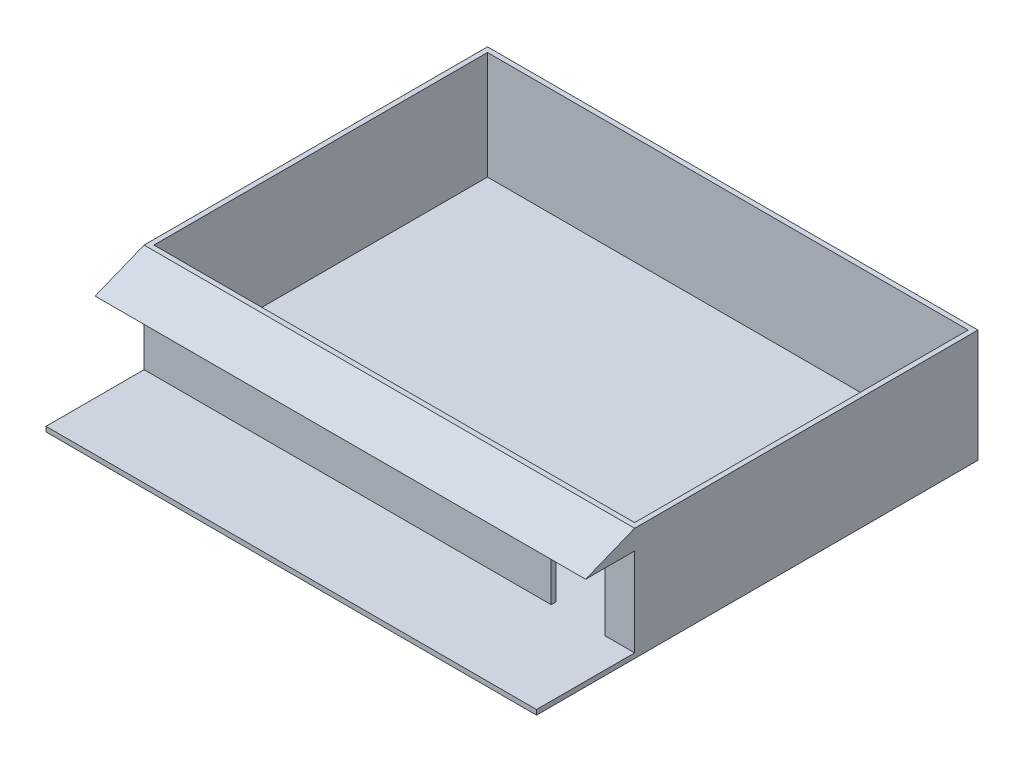
ISO-10303-21;
HEADER;
FILE_DESCRIPTION(('STEP AP214'),'2;1');
FILE_NAME('part.step','',(''),(''),'','','');
FILE_SCHEMA(('AUTOMOTIVE_DESIGN { 1 0 10303 214 1 1 1 1 }'));
ENDSEC;
DATA;
#1=APPLICATION_CONTEXT('core data for automotive mechanical design processes');
#2=APPLICATION_PROTOCOL_DEFINITION('international standard','automotive_design',2000,#1);
#3=PRODUCT_CONTEXT('',#1,'mechanical');
#4=PRODUCT('Part','Part','',(#3));
#5=PRODUCT_RELATED_PRODUCT_CATEGORY('part','',(#4));
#6=PRODUCT_DEFINITION_FORMATION('','',#4);
#7=PRODUCT_DEFINITION_CONTEXT('part definition',#1,'design');
#8=PRODUCT_DEFINITION('design','',#6,#7);
#9=PRODUCT_DEFINITION_SHAPE('','',#8);
#10=(LENGTH_UNIT() NAMED_UNIT(*) SI_UNIT(.MILLI.,.METRE.));
#11=(NAMED_UNIT(*) PLANE_ANGLE_UNIT() SI_UNIT($,.RADIAN.));
#12=(NAMED_UNIT(*) SI_UNIT($,.STERADIAN.) SOLID_ANGLE_UNIT());
#13=UNCERTAINTY_MEASURE_WITH_UNIT(LENGTH_MEASURE(1.E-05),#10,'distance_accuracy_value','');
#14=(GEOMETRIC_REPRESENTATION_CONTEXT(3) GLOBAL_UNCERTAINTY_ASSIGNED_CONTEXT((#13)) GLOBAL_UNIT_ASSIGNED_CONTEXT((#10,
#11,#12)) REPRESENTATION_CONTEXT('',''));
#15=CARTESIAN_POINT('',(0.,0.,0.));
#16=DIRECTION('',(0.,0.,1.));
#17=DIRECTION('',(1.,0.,0.));
#18=AXIS2_PLACEMENT_3D('',#15,#16,#17);
#19=CARTESIAN_POINT('',(-500.,230.,250.));
#20=DIRECTION('',(0.,0.,-1.));
#21=DIRECTION('',(-1.,0.,0.));
#22=AXIS2_PLACEMENT_3D('',#19,#20,#21);
#23=PLANE('',#22);
#24=DIRECTION('',(0.,-1.,0.));
#25=VECTOR('',#24,1.);
#26=CARTESIAN_POINT('',(500.,230.,250.));
#27=LINE('',#26,#25);
#28=CARTESIAN_POINT('',(500.,190.,250.));
#29=VERTEX_POINT('',#28);
#30=CARTESIAN_POINT('',(500.,10.,250.));
#31=VERTEX_POINT('',#30);
#32=EDGE_CURVE('E164',#29,#31,#27,.T.);
#33=ORIENTED_EDGE('',*,*,#32,.F.);
#34=DIRECTION('',(-1.,0.,0.));
#35=VECTOR('',#34,1.);
#36=CARTESIAN_POINT('',(607.70329614269,190.,250.));
#37=LINE('',#36,#35);
#38=CARTESIAN_POINT('',(-500.,190.,250.));
#39=VERTEX_POINT('',#38);
#40=EDGE_CURVE('E149',#29,#39,#37,.T.);
#41=ORIENTED_EDGE('',*,*,#40,.T.);
#42=DIRECTION('',(0.,-1.,0.));
#43=VECTOR('',#42,1.);
#44=CARTESIAN_POINT('',(-500.,230.,250.));
#45=LINE('',#44,#43);
#46=CARTESIAN_POINT('',(-500.,10.,250.));
#47=VERTEX_POINT('',#46);
#48=EDGE_CURVE('E161',#39,#47,#45,.T.);
#49=ORIENTED_EDGE('',*,*,#48,.T.);
#50=DIRECTION('',(1.,0.,0.));
#51=VECTOR('',#50,1.);
#52=CARTESIAN_POINT('',(-500.,10.,250.));
#53=LINE('',#52,#51);
#54=CARTESIAN_POINT('',(330.,10.,250.));
#55=VERTEX_POINT('',#54);
#56=EDGE_CURVE('E222',#47,#55,#53,.T.);
#57=ORIENTED_EDGE('',*,*,#56,.T.);
#58=DIRECTION('',(0.,1.,0.));
#59=VECTOR('',#58,1.);
#60=CARTESIAN_POINT('',(330.,230.,250.));
#61=LINE('',#60,#59);
#62=CARTESIAN_POINT('',(330.,180.,250.));
#63=VERTEX_POINT('',#62);
#64=EDGE_CURVE('E276',#55,#63,#61,.T.);
#65=ORIENTED_EDGE('',*,*,#64,.T.);
#66=DIRECTION('',(1.,0.,0.));
#67=VECTOR('',#66,1.);
#68=CARTESIAN_POINT('',(-500.,180.,250.));
#69=LINE('',#68,#67);
#70=CARTESIAN_POINT('',(440.,180.,250.));
#71=VERTEX_POINT('',#70);
#72=EDGE_CURVE('E261',#63,#71,#69,.T.);
#73=ORIENTED_EDGE('',*,*,#72,.T.);
#74=DIRECTION('',(0.,1.,0.));
#75=VECTOR('',#74,1.);
#76=CARTESIAN_POINT('',(440.,230.,250.));
#77=LINE('',#76,#75);
#78=CARTESIAN_POINT('',(440.,10.,250.));
#79=VERTEX_POINT('',#78);
#80=EDGE_CURVE('E271',#79,#71,#77,.T.);
#81=ORIENTED_EDGE('',*,*,#80,.F.);
#82=EDGE_CURVE('E227',#79,#31,#53,.T.);
#83=ORIENTED_EDGE('',*,*,#82,.T.);
#84=EDGE_LOOP('',(#33,#41,#49,#57,#65,#73,#81,#83));
#85=FACE_BOUND('',#84,.T.);
#86=ADVANCED_FACE('F34',(#85),#23,.F.);
#87=CARTESIAN_POINT('',(-490.,230.,240.));
#88=DIRECTION('',(0.,0.,-1.));
#89=DIRECTION('',(-1.,0.,0.));
#90=AXIS2_PLACEMENT_3D('',#87,#88,#89);
#91=PLANE('',#90);
#92=DIRECTION('',(1.,0.,0.));
#93=VECTOR('',#92,1.);
#94=CARTESIAN_POINT('',(-490.,10.,240.));
#95=LINE('',#94,#93);
#96=CARTESIAN_POINT('',(440.,10.,240.));
#97=VERTEX_POINT('',#96);
#98=CARTESIAN_POINT('',(490.,10.,240.));
#99=VERTEX_POINT('',#98);
#100=EDGE_CURVE('E251',#97,#99,#95,.T.);
#101=ORIENTED_EDGE('',*,*,#100,.F.);
#102=DIRECTION('',(0.,1.,0.));
#103=VECTOR('',#102,1.);
#104=CARTESIAN_POINT('',(440.,230.,240.));
#105=LINE('',#104,#103);
#106=CARTESIAN_POINT('',(440.,180.,240.));
#107=VERTEX_POINT('',#106);
#108=EDGE_CURVE('E273',#97,#107,#105,.T.);
#109=ORIENTED_EDGE('',*,*,#108,.T.);
#110=DIRECTION('',(1.,0.,0.));
#111=VECTOR('',#110,1.);
#112=CARTESIAN_POINT('',(-490.,180.,240.));
#113=LINE('',#112,#111);
#114=CARTESIAN_POINT('',(330.,180.,240.));
#115=VERTEX_POINT('',#114);
#116=EDGE_CURVE('E11',#115,#107,#113,.T.);
#117=ORIENTED_EDGE('',*,*,#116,.F.);
#118=DIRECTION('',(0.,1.,0.));
#119=VECTOR('',#118,1.);
#120=CARTESIAN_POINT('',(330.,230.,240.));
#121=LINE('',#120,#119);
#122=CARTESIAN_POINT('',(330.,10.,240.));
#123=VERTEX_POINT('',#122);
#124=EDGE_CURVE('E278',#123,#115,#121,.T.);
#125=ORIENTED_EDGE('',*,*,#124,.F.);
#126=CARTESIAN_POINT('',(-490.,10.,240.));
#127=VERTEX_POINT('',#126);
#128=EDGE_CURVE('E248',#127,#123,#95,.T.);
#129=ORIENTED_EDGE('',*,*,#128,.F.);
#130=DIRECTION('',(0.,-1.,0.));
#131=VECTOR('',#130,1.);
#132=CARTESIAN_POINT('',(-490.,230.,240.));
#133=LINE('',#132,#131);
#134=CARTESIAN_POINT('',(-490.,230.,240.));
#135=VERTEX_POINT('',#134);
#136=EDGE_CURVE('E241',#135,#127,#133,.T.);
#137=ORIENTED_EDGE('',*,*,#136,.F.);
#138=DIRECTION('',(1.,0.,0.));
#139=VECTOR('',#138,1.);
#140=CARTESIAN_POINT('',(-490.,230.,240.));
#141=LINE('',#140,#139);
#142=CARTESIAN_POINT('',(490.,230.,240.));
#143=VERTEX_POINT('',#142);
#144=EDGE_CURVE('E247',#135,#143,#141,.T.);
#145=ORIENTED_EDGE('',*,*,#144,.T.);
#146=DIRECTION('',(0.,-1.,0.));
#147=VECTOR('',#146,1.);
#148=CARTESIAN_POINT('',(490.,230.,240.));
#149=LINE('',#148,#147);
#150=EDGE_CURVE('E244',#143,#99,#149,.T.);
#151=ORIENTED_EDGE('',*,*,#150,.T.);
#152=EDGE_LOOP('',(#101,#109,#117,#125,#129,#137,#145,#151));
#153=FACE_BOUND('',#152,.T.);
#154=ADVANCED_FACE('F313',(#153),#91,.T.);
#155=CARTESIAN_POINT('',(500.,10.,-450.));
#156=DIRECTION('',(-1.,0.,0.));
#157=DIRECTION('',(0.,0.,1.));
#158=AXIS2_PLACEMENT_3D('',#155,#156,#157);
#159=PLANE('',#158);
#160=DIRECTION('',(0.,0.,-1.));
#161=VECTOR('',#160,1.);
#162=CARTESIAN_POINT('',(500.,0.,-450.));
#163=LINE('',#162,#161);
#164=CARTESIAN_POINT('',(500.,0.,450.));
#165=VERTEX_POINT('',#164);
#166=CARTESIAN_POINT('',(500.,0.,-450.));
#167=VERTEX_POINT('',#166);
#168=EDGE_CURVE('E170',#165,#167,#163,.T.);
#169=ORIENTED_EDGE('',*,*,#168,.T.);
#170=DIRECTION('',(0.,-1.,0.));
#171=VECTOR('',#170,1.);
#172=CARTESIAN_POINT('',(500.,10.,-450.));
#173=LINE('',#172,#171);
#174=CARTESIAN_POINT('',(500.,230.,-450.));
#175=VERTEX_POINT('',#174);
#176=EDGE_CURVE('E42',#175,#167,#173,.T.);
#177=ORIENTED_EDGE('',*,*,#176,.F.);
#178=DIRECTION('',(0.,0.,-1.));
#179=VECTOR('',#178,1.);
#180=CARTESIAN_POINT('',(500.,230.,250.));
#181=LINE('',#180,#179);
#182=CARTESIAN_POINT('',(500.,230.,250.));
#183=VERTEX_POINT('',#182);
#184=EDGE_CURVE('E226',#183,#175,#181,.T.);
#185=ORIENTED_EDGE('',*,*,#184,.F.);
#186=DIRECTION('',(0.,-0.371390676354103,0.928476690885259));
#187=VECTOR('',#186,1.);
#188=CARTESIAN_POINT('',(500.,230.,250.));
#189=LINE('',#188,#187);
#190=CARTESIAN_POINT('',(500.,190.,350.));
#191=VERTEX_POINT('',#190);
#192=EDGE_CURVE('E286',#183,#191,#189,.T.);
#193=ORIENTED_EDGE('',*,*,#192,.T.);
#194=DIRECTION('',(0.,0.,-1.));
#195=VECTOR('',#194,1.);
#196=CARTESIAN_POINT('',(500.,190.,350.));
#197=LINE('',#196,#195);
#198=EDGE_CURVE('E285',#191,#29,#197,.T.);
#199=ORIENTED_EDGE('',*,*,#198,.T.);
#200=ORIENTED_EDGE('',*,*,#32,.T.);
#201=DIRECTION('',(0.,0.,-1.));
#202=VECTOR('',#201,1.);
#203=CARTESIAN_POINT('',(500.,10.,-450.));
#204=LINE('',#203,#202);
#205=CARTESIAN_POINT('',(500.,10.,450.));
#206=VERTEX_POINT('',#205);
#207=EDGE_CURVE('E179',#206,#31,#204,.T.);
#208=ORIENTED_EDGE('',*,*,#207,.F.);
#209=DIRECTION('',(0.,-1.,0.));
#210=VECTOR('',#209,1.);
#211=CARTESIAN_POINT('',(500.,10.,450.));
#212=LINE('',#211,#210);
#213=EDGE_CURVE('E185',#206,#165,#212,.T.);
#214=ORIENTED_EDGE('',*,*,#213,.T.);
#215=EDGE_LOOP('',(#169,#177,#185,#193,#199,#200,#208,#214));
#216=FACE_BOUND('',#215,.T.);
#217=ADVANCED_FACE('F36',(#216),#159,.F.);
#218=CARTESIAN_POINT('',(-500.,10.,-450.));
#219=DIRECTION('',(0.,0.,1.));
#220=DIRECTION('',(1.,0.,0.));
#221=AXIS2_PLACEMENT_3D('',#218,#219,#220);
#222=PLANE('',#221);
#223=DIRECTION('',(-1.,0.,0.));
#224=VECTOR('',#223,1.);
#225=CARTESIAN_POINT('',(-500.,0.,-450.));
#226=LINE('',#225,#224);
#227=CARTESIAN_POINT('',(-500.,0.,-450.));
#228=VERTEX_POINT('',#227);
#229=EDGE_CURVE('E173',#167,#228,#226,.T.);
#230=ORIENTED_EDGE('',*,*,#229,.T.);
#231=DIRECTION('',(0.,-1.,0.));
#232=VECTOR('',#231,1.);
#233=CARTESIAN_POINT('',(-500.,10.,-450.));
#234=LINE('',#233,#232);
#235=CARTESIAN_POINT('',(-500.,230.,-450.));
#236=VERTEX_POINT('',#235);
#237=EDGE_CURVE('E196',#236,#228,#234,.T.);
#238=ORIENTED_EDGE('',*,*,#237,.F.);
#239=DIRECTION('',(-1.,0.,0.));
#240=VECTOR('',#239,1.);
#241=CARTESIAN_POINT('',(-500.,230.,-450.));
#242=LINE('',#241,#240);
#243=EDGE_CURVE('E203',#175,#236,#242,.T.);
#244=ORIENTED_EDGE('',*,*,#243,.F.);
#245=ORIENTED_EDGE('',*,*,#176,.T.);
#246=EDGE_LOOP('',(#230,#238,#244,#245));
#247=FACE_BOUND('',#246,.T.);
#248=ADVANCED_FACE('F201',(#247),#222,.F.);
#249=CARTESIAN_POINT('',(-500.,10.,-450.));
#250=DIRECTION('',(1.,0.,0.));
#251=DIRECTION('',(0.,0.,-1.));
#252=AXIS2_PLACEMENT_3D('',#249,#250,#251);
#253=PLANE('',#252);
#254=DIRECTION('',(0.,0.,1.));
#255=VECTOR('',#254,1.);
#256=CARTESIAN_POINT('',(-500.,0.,-450.));
#257=LINE('',#256,#255);
#258=CARTESIAN_POINT('',(-500.,0.,450.));
#259=VERTEX_POINT('',#258);
#260=EDGE_CURVE('E188',#228,#259,#257,.T.);
#261=ORIENTED_EDGE('',*,*,#260,.T.);
#262=DIRECTION('',(0.,-1.,0.));
#263=VECTOR('',#262,1.);
#264=CARTESIAN_POINT('',(-500.,10.,450.));
#265=LINE('',#264,#263);
#266=CARTESIAN_POINT('',(-500.,10.,450.));
#267=VERTEX_POINT('',#266);
#268=EDGE_CURVE('E193',#267,#259,#265,.T.);
#269=ORIENTED_EDGE('',*,*,#268,.F.);
#270=DIRECTION('',(0.,0.,1.));
#271=VECTOR('',#270,1.);
#272=CARTESIAN_POINT('',(-500.,10.,-450.));
#273=LINE('',#272,#271);
#274=EDGE_CURVE('E169',#47,#267,#273,.T.);
#275=ORIENTED_EDGE('',*,*,#274,.F.);
#276=ORIENTED_EDGE('',*,*,#48,.F.);
#277=DIRECTION('',(0.,0.,1.));
#278=VECTOR('',#277,1.);
#279=CARTESIAN_POINT('',(-500.,190.,350.));
#280=LINE('',#279,#278);
#281=CARTESIAN_POINT('',(-500.,190.,350.));
#282=VERTEX_POINT('',#281);
#283=EDGE_CURVE('E145',#39,#282,#280,.T.);
#284=ORIENTED_EDGE('',*,*,#283,.T.);
#285=DIRECTION('',(0.,0.371390676354103,-0.928476690885259));
#286=VECTOR('',#285,1.);
#287=CARTESIAN_POINT('',(-500.,230.,250.));
#288=LINE('',#287,#286);
#289=CARTESIAN_POINT('',(-500.,230.,250.));
#290=VERTEX_POINT('',#289);
#291=EDGE_CURVE('E157',#282,#290,#288,.T.);
#292=ORIENTED_EDGE('',*,*,#291,.T.);
#293=DIRECTION('',(0.,0.,1.));
#294=VECTOR('',#293,1.);
#295=CARTESIAN_POINT('',(-500.,230.,250.));
#296=LINE('',#295,#294);
#297=EDGE_CURVE('E233',#236,#290,#296,.T.);
#298=ORIENTED_EDGE('',*,*,#297,.F.);
#299=ORIENTED_EDGE('',*,*,#237,.T.);
#300=EDGE_LOOP('',(#261,#269,#275,#276,#284,#292,#298,#299));
#301=FACE_BOUND('',#300,.T.);
#302=ADVANCED_FACE('F167',(#301),#253,.F.);
#303=CARTESIAN_POINT('',(-500.,10.,450.));
#304=DIRECTION('',(0.,0.,-1.));
#305=DIRECTION('',(-1.,0.,0.));
#306=AXIS2_PLACEMENT_3D('',#303,#304,#305);
#307=PLANE('',#306);
#308=DIRECTION('',(1.,0.,0.));
#309=VECTOR('',#308,1.);
#310=CARTESIAN_POINT('',(-500.,0.,450.));
#311=LINE('',#310,#309);
#312=EDGE_CURVE('E182',#259,#165,#311,.T.);
#313=ORIENTED_EDGE('',*,*,#312,.T.);
#314=ORIENTED_EDGE('',*,*,#213,.F.);
#315=DIRECTION('',(1.,0.,0.));
#316=VECTOR('',#315,1.);
#317=CARTESIAN_POINT('',(-500.,10.,450.));
#318=LINE('',#317,#316);
#319=EDGE_CURVE('E184',#267,#206,#318,.T.);
#320=ORIENTED_EDGE('',*,*,#319,.F.);
#321=ORIENTED_EDGE('',*,*,#268,.T.);
#322=EDGE_LOOP('',(#313,#314,#320,#321));
#323=FACE_BOUND('',#322,.T.);
#324=ADVANCED_FACE('F217',(#323),#307,.F.);
#325=CARTESIAN_POINT('',(0.,10.,0.));
#326=DIRECTION('',(0.,1.,0.));
#327=DIRECTION('',(0.,0.,1.));
#328=AXIS2_PLACEMENT_3D('',#325,#326,#327);
#329=PLANE('',#328);
#330=ORIENTED_EDGE('',*,*,#319,.T.);
#331=ORIENTED_EDGE('',*,*,#207,.T.);
#332=ORIENTED_EDGE('',*,*,#82,.F.);
#333=DIRECTION('',(0.,0.,1.));
#334=VECTOR('',#333,1.);
#335=CARTESIAN_POINT('',(440.,10.,170.));
#336=LINE('',#335,#334);
#337=EDGE_CURVE('E280',#97,#79,#336,.T.);
#338=ORIENTED_EDGE('',*,*,#337,.F.);
#339=ORIENTED_EDGE('',*,*,#100,.T.);
#340=DIRECTION('',(0.,0.,-1.));
#341=VECTOR('',#340,1.);
#342=CARTESIAN_POINT('',(490.,10.,240.));
#343=LINE('',#342,#341);
#344=CARTESIAN_POINT('',(490.,10.,-440.));
#345=VERTEX_POINT('',#344);
#346=EDGE_CURVE('E258',#99,#345,#343,.T.);
#347=ORIENTED_EDGE('',*,*,#346,.T.);
#348=DIRECTION('',(-1.,0.,0.));
#349=VECTOR('',#348,1.);
#350=CARTESIAN_POINT('',(-490.,10.,-440.));
#351=LINE('',#350,#349);
#352=CARTESIAN_POINT('',(-490.,10.,-440.));
#353=VERTEX_POINT('',#352);
#354=EDGE_CURVE('E255',#345,#353,#351,.T.);
#355=ORIENTED_EDGE('',*,*,#354,.T.);
#356=DIRECTION('',(0.,0.,1.));
#357=VECTOR('',#356,1.);
#358=CARTESIAN_POINT('',(-490.,10.,240.));
#359=LINE('',#358,#357);
#360=EDGE_CURVE('E252',#353,#127,#359,.T.);
#361=ORIENTED_EDGE('',*,*,#360,.T.);
#362=ORIENTED_EDGE('',*,*,#128,.T.);
#363=DIRECTION('',(0.,0.,1.));
#364=VECTOR('',#363,1.);
#365=CARTESIAN_POINT('',(330.,10.,170.));
#366=LINE('',#365,#364);
#367=EDGE_CURVE('E224',#123,#55,#366,.T.);
#368=ORIENTED_EDGE('',*,*,#367,.T.);
#369=ORIENTED_EDGE('',*,*,#56,.F.);
#370=ORIENTED_EDGE('',*,*,#274,.T.);
#371=EDGE_LOOP('',(#330,#331,#332,#338,#339,#347,#355,#361,#362,#368,#369,#370));
#372=FACE_BOUND('',#371,.T.);
#373=ADVANCED_FACE('F219',(#372),#329,.T.);
#374=CARTESIAN_POINT('',(0.,0.,0.));
#375=DIRECTION('',(0.,1.,0.));
#376=DIRECTION('',(0.,0.,1.));
#377=AXIS2_PLACEMENT_3D('',#374,#375,#376);
#378=PLANE('',#377);
#379=ORIENTED_EDGE('',*,*,#168,.F.);
#380=ORIENTED_EDGE('',*,*,#312,.F.);
#381=ORIENTED_EDGE('',*,*,#260,.F.);
#382=ORIENTED_EDGE('',*,*,#229,.F.);
#383=EDGE_LOOP('',(#379,#380,#381,#382));
#384=FACE_BOUND('',#383,.T.);
#385=ADVANCED_FACE('F212',(#384),#378,.F.);
#386=CARTESIAN_POINT('',(0.,230.,0.));
#387=DIRECTION('',(0.,-1.,0.));
#388=DIRECTION('',(0.,0.,-1.));
#389=AXIS2_PLACEMENT_3D('',#386,#387,#388);
#390=PLANE('',#389);
#391=ORIENTED_EDGE('',*,*,#184,.T.);
#392=ORIENTED_EDGE('',*,*,#243,.T.);
#393=ORIENTED_EDGE('',*,*,#297,.T.);
#394=DIRECTION('',(1.,0.,0.));
#395=VECTOR('',#394,1.);
#396=CARTESIAN_POINT('',(-500.,230.,250.));
#397=LINE('',#396,#395);
#398=EDGE_CURVE('E175',#290,#183,#397,.T.);
#399=ORIENTED_EDGE('',*,*,#398,.T.);
#400=EDGE_LOOP('',(#391,#392,#393,#399));
#401=FACE_BOUND('',#400,.T.);
#402=DIRECTION('',(0.,0.,-1.));
#403=VECTOR('',#402,1.);
#404=CARTESIAN_POINT('',(490.,230.,240.));
#405=LINE('',#404,#403);
#406=CARTESIAN_POINT('',(490.,230.,-440.));
#407=VERTEX_POINT('',#406);
#408=EDGE_CURVE('E250',#143,#407,#405,.T.);
#409=ORIENTED_EDGE('',*,*,#408,.F.);
#410=ORIENTED_EDGE('',*,*,#144,.F.);
#411=DIRECTION('',(0.,0.,1.));
#412=VECTOR('',#411,1.);
#413=CARTESIAN_POINT('',(-490.,230.,240.));
#414=LINE('',#413,#412);
#415=CARTESIAN_POINT('',(-490.,230.,-440.));
#416=VERTEX_POINT('',#415);
#417=EDGE_CURVE('E263',#416,#135,#414,.T.);
#418=ORIENTED_EDGE('',*,*,#417,.F.);
#419=DIRECTION('',(-1.,0.,0.));
#420=VECTOR('',#419,1.);
#421=CARTESIAN_POINT('',(-490.,230.,-440.));
#422=LINE('',#421,#420);
#423=EDGE_CURVE('E266',#407,#416,#422,.T.);
#424=ORIENTED_EDGE('',*,*,#423,.F.);
#425=EDGE_LOOP('',(#409,#410,#418,#424));
#426=FACE_BOUND('',#425,.T.);
#427=ADVANCED_FACE('F293',(#401,#426),#390,.F.);
#428=CARTESIAN_POINT('',(490.,230.,240.));
#429=DIRECTION('',(-1.,0.,0.));
#430=DIRECTION('',(0.,0.,1.));
#431=AXIS2_PLACEMENT_3D('',#428,#429,#430);
#432=PLANE('',#431);
#433=ORIENTED_EDGE('',*,*,#346,.F.);
#434=ORIENTED_EDGE('',*,*,#150,.F.);
#435=ORIENTED_EDGE('',*,*,#408,.T.);
#436=DIRECTION('',(0.,-1.,0.));
#437=VECTOR('',#436,1.);
#438=CARTESIAN_POINT('',(490.,230.,-440.));
#439=LINE('',#438,#437);
#440=EDGE_CURVE('E229',#407,#345,#439,.T.);
#441=ORIENTED_EDGE('',*,*,#440,.T.);
#442=EDGE_LOOP('',(#433,#434,#435,#441));
#443=FACE_BOUND('',#442,.T.);
#444=ADVANCED_FACE('F296',(#443),#432,.T.);
#445=CARTESIAN_POINT('',(-490.,230.,-440.));
#446=DIRECTION('',(0.,0.,1.));
#447=DIRECTION('',(1.,0.,0.));
#448=AXIS2_PLACEMENT_3D('',#445,#446,#447);
#449=PLANE('',#448);
#450=ORIENTED_EDGE('',*,*,#354,.F.);
#451=ORIENTED_EDGE('',*,*,#440,.F.);
#452=ORIENTED_EDGE('',*,*,#423,.T.);
#453=DIRECTION('',(0.,-1.,0.));
#454=VECTOR('',#453,1.);
#455=CARTESIAN_POINT('',(-490.,230.,-440.));
#456=LINE('',#455,#454);
#457=EDGE_CURVE('E239',#416,#353,#456,.T.);
#458=ORIENTED_EDGE('',*,*,#457,.T.);
#459=EDGE_LOOP('',(#450,#451,#452,#458));
#460=FACE_BOUND('',#459,.T.);
#461=ADVANCED_FACE('F307',(#460),#449,.T.);
#462=CARTESIAN_POINT('',(-490.,230.,240.));
#463=DIRECTION('',(1.,0.,0.));
#464=DIRECTION('',(0.,0.,-1.));
#465=AXIS2_PLACEMENT_3D('',#462,#463,#464);
#466=PLANE('',#465);
#467=ORIENTED_EDGE('',*,*,#360,.F.);
#468=ORIENTED_EDGE('',*,*,#457,.F.);
#469=ORIENTED_EDGE('',*,*,#417,.T.);
#470=ORIENTED_EDGE('',*,*,#136,.T.);
#471=EDGE_LOOP('',(#467,#468,#469,#470));
#472=FACE_BOUND('',#471,.T.);
#473=ADVANCED_FACE('F316',(#472),#466,.T.);
#474=CARTESIAN_POINT('',(440.,180.,170.));
#475=DIRECTION('',(0.,1.,0.));
#476=DIRECTION('',(0.,0.,1.));
#477=AXIS2_PLACEMENT_3D('',#474,#475,#476);
#478=PLANE('',#477);
#479=DIRECTION('',(0.,0.,1.));
#480=VECTOR('',#479,1.);
#481=CARTESIAN_POINT('',(330.,180.,170.));
#482=LINE('',#481,#480);
#483=EDGE_CURVE('E53',#115,#63,#482,.T.);
#484=ORIENTED_EDGE('',*,*,#483,.F.);
#485=ORIENTED_EDGE('',*,*,#116,.T.);
#486=DIRECTION('',(0.,0.,1.));
#487=VECTOR('',#486,1.);
#488=CARTESIAN_POINT('',(440.,180.,170.));
#489=LINE('',#488,#487);
#490=EDGE_CURVE('E48',#107,#71,#489,.T.);
#491=ORIENTED_EDGE('',*,*,#490,.T.);
#492=ORIENTED_EDGE('',*,*,#72,.F.);
#493=EDGE_LOOP('',(#484,#485,#491,#492));
#494=FACE_BOUND('',#493,.T.);
#495=ADVANCED_FACE('F318',(#494),#478,.F.);
#496=CARTESIAN_POINT('',(440.,180.,170.));
#497=DIRECTION('',(-1.,0.,0.));
#498=DIRECTION('',(0.,-1.,0.));
#499=AXIS2_PLACEMENT_3D('',#496,#497,#498);
#500=PLANE('',#499);
#501=ORIENTED_EDGE('',*,*,#80,.T.);
#502=ORIENTED_EDGE('',*,*,#490,.F.);
#503=ORIENTED_EDGE('',*,*,#108,.F.);
#504=ORIENTED_EDGE('',*,*,#337,.T.);
#505=EDGE_LOOP('',(#501,#502,#503,#504));
#506=FACE_BOUND('',#505,.T.);
#507=ADVANCED_FACE('F324',(#506),#500,.T.);
#508=CARTESIAN_POINT('',(330.,180.,170.));
#509=DIRECTION('',(-1.,0.,0.));
#510=DIRECTION('',(0.,0.,1.));
#511=AXIS2_PLACEMENT_3D('',#508,#509,#510);
#512=PLANE('',#511);
#513=ORIENTED_EDGE('',*,*,#367,.F.);
#514=ORIENTED_EDGE('',*,*,#124,.T.);
#515=ORIENTED_EDGE('',*,*,#483,.T.);
#516=ORIENTED_EDGE('',*,*,#64,.F.);
#517=EDGE_LOOP('',(#513,#514,#515,#516));
#518=FACE_BOUND('',#517,.T.);
#519=ADVANCED_FACE('F368',(#518),#512,.F.);
#520=CARTESIAN_POINT('',(607.70329614269,230.,250.));
#521=DIRECTION('',(0.,0.928476690885259,0.371390676354103));
#522=DIRECTION('',(0.,-0.371390676354103,0.928476690885259));
#523=AXIS2_PLACEMENT_3D('',#520,#521,#522);
#524=PLANE('',#523);
#525=ORIENTED_EDGE('',*,*,#192,.F.);
#526=ORIENTED_EDGE('',*,*,#398,.F.);
#527=ORIENTED_EDGE('',*,*,#291,.F.);
#528=DIRECTION('',(-1.,0.,0.));
#529=VECTOR('',#528,1.);
#530=CARTESIAN_POINT('',(607.70329614269,190.,350.));
#531=LINE('',#530,#529);
#532=EDGE_CURVE('E152',#191,#282,#531,.T.);
#533=ORIENTED_EDGE('',*,*,#532,.F.);
#534=EDGE_LOOP('',(#525,#526,#527,#533));
#535=FACE_BOUND('',#534,.T.);
#536=ADVANCED_FACE('F291',(#535),#524,.T.);
#537=CARTESIAN_POINT('',(607.70329614269,190.,350.));
#538=DIRECTION('',(0.,-1.,0.));
#539=DIRECTION('',(0.,0.,-1.));
#540=AXIS2_PLACEMENT_3D('',#537,#538,#539);
#541=PLANE('',#540);
#542=ORIENTED_EDGE('',*,*,#198,.F.);
#543=ORIENTED_EDGE('',*,*,#532,.T.);
#544=ORIENTED_EDGE('',*,*,#283,.F.);
#545=ORIENTED_EDGE('',*,*,#40,.F.);
#546=EDGE_LOOP('',(#542,#543,#544,#545));
#547=FACE_BOUND('',#546,.T.);
#548=ADVANCED_FACE('F148',(#547),#541,.T.);
#549=CLOSED_SHELL('',(#86,#154,#217,#248,#302,#324,#373,#385,#427,#444,#461,#473,#495,#507,#519,
#536,#548));
#550=MANIFOLD_SOLID_BREP('B2',#549);
#551=ADVANCED_BREP_SHAPE_REPRESENTATION('',(#18,#550),#14);
#552=SHAPE_DEFINITION_REPRESENTATION(#9,#551);
ENDSEC;
END-ISO-10303-21;
